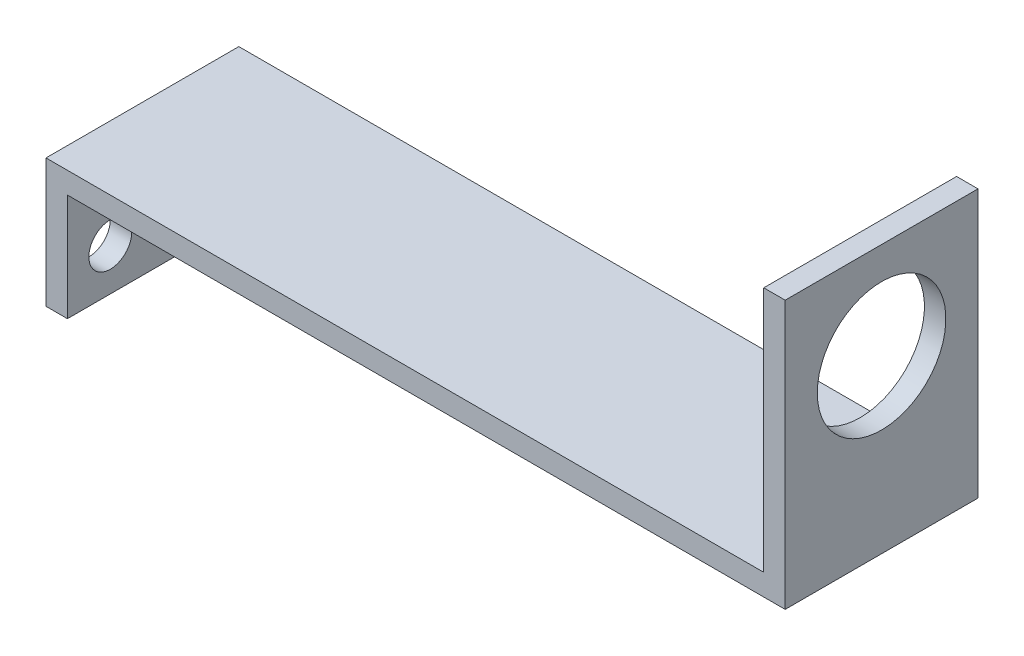
ISO-10303-21;
HEADER;
FILE_DESCRIPTION(('STEP AP214'),'2;1');
FILE_NAME('part.step','',(''),(''),'','','');
FILE_SCHEMA(('AUTOMOTIVE_DESIGN { 1 0 10303 214 1 1 1 1 }'));
ENDSEC;
DATA;
#1=APPLICATION_CONTEXT('core data for automotive mechanical design processes');
#2=APPLICATION_PROTOCOL_DEFINITION('international standard','automotive_design',2000,#1);
#3=PRODUCT_CONTEXT('',#1,'mechanical');
#4=PRODUCT('Part','Part','',(#3));
#5=PRODUCT_RELATED_PRODUCT_CATEGORY('part','',(#4));
#6=PRODUCT_DEFINITION_FORMATION('','',#4);
#7=PRODUCT_DEFINITION_CONTEXT('part definition',#1,'design');
#8=PRODUCT_DEFINITION('design','',#6,#7);
#9=PRODUCT_DEFINITION_SHAPE('','',#8);
#10=(LENGTH_UNIT() NAMED_UNIT(*) SI_UNIT(.MILLI.,.METRE.));
#11=(NAMED_UNIT(*) PLANE_ANGLE_UNIT() SI_UNIT($,.RADIAN.));
#12=(NAMED_UNIT(*) SI_UNIT($,.STERADIAN.) SOLID_ANGLE_UNIT());
#13=UNCERTAINTY_MEASURE_WITH_UNIT(LENGTH_MEASURE(1.E-05),#10,'distance_accuracy_value','');
#14=(GEOMETRIC_REPRESENTATION_CONTEXT(3) GLOBAL_UNCERTAINTY_ASSIGNED_CONTEXT((#13)) GLOBAL_UNIT_ASSIGNED_CONTEXT((#10,
#11,#12)) REPRESENTATION_CONTEXT('',''));
#15=CARTESIAN_POINT('',(0.,0.,0.));
#16=DIRECTION('',(0.,0.,1.));
#17=DIRECTION('',(1.,0.,0.));
#18=AXIS2_PLACEMENT_3D('',#15,#16,#17);
#19=CARTESIAN_POINT('',(2.,0.,18.));
#20=DIRECTION('',(0.,1.,0.));
#21=DIRECTION('',(-1.,0.,0.));
#22=AXIS2_PLACEMENT_3D('',#19,#20,#21);
#23=PLANE('',#22);
#24=DIRECTION('',(1.,0.,0.));
#25=VECTOR('',#24,1.);
#26=CARTESIAN_POINT('',(2.,0.,0.));
#27=LINE('',#26,#25);
#28=CARTESIAN_POINT('',(0.,0.,0.));
#29=VERTEX_POINT('',#28);
#30=CARTESIAN_POINT('',(2.,0.,0.));
#31=VERTEX_POINT('',#30);
#32=EDGE_CURVE('E129',#29,#31,#27,.T.);
#33=ORIENTED_EDGE('',*,*,#32,.T.);
#34=DIRECTION('',(0.,0.,-1.));
#35=VECTOR('',#34,1.);
#36=CARTESIAN_POINT('',(2.,0.,18.));
#37=LINE('',#36,#35);
#38=CARTESIAN_POINT('',(2.,0.,18.));
#39=VERTEX_POINT('',#38);
#40=EDGE_CURVE('E11',#39,#31,#37,.T.);
#41=ORIENTED_EDGE('',*,*,#40,.F.);
#42=DIRECTION('',(1.,0.,0.));
#43=VECTOR('',#42,1.);
#44=CARTESIAN_POINT('',(2.,0.,18.));
#45=LINE('',#44,#43);
#46=CARTESIAN_POINT('',(0.,0.,18.));
#47=VERTEX_POINT('',#46);
#48=EDGE_CURVE('E144',#47,#39,#45,.T.);
#49=ORIENTED_EDGE('',*,*,#48,.F.);
#50=DIRECTION('',(0.,0.,-1.));
#51=VECTOR('',#50,1.);
#52=CARTESIAN_POINT('',(0.,0.,18.));
#53=LINE('',#52,#51);
#54=EDGE_CURVE('E125',#47,#29,#53,.T.);
#55=ORIENTED_EDGE('',*,*,#54,.T.);
#56=EDGE_LOOP('',(#33,#41,#49,#55));
#57=FACE_BOUND('',#56,.T.);
#58=ADVANCED_FACE('F33',(#57),#23,.F.);
#59=CARTESIAN_POINT('',(2.,9.99999999999999,18.));
#60=DIRECTION('',(-1.,0.,0.));
#61=DIRECTION('',(0.,-1.,0.));
#62=AXIS2_PLACEMENT_3D('',#59,#60,#61);
#63=PLANE('',#62);
#64=CARTESIAN_POINT('',(2.,4.,4.));
#65=DIRECTION('',(-1.,0.,0.));
#66=DIRECTION('',(0.,-1.,0.));
#67=AXIS2_PLACEMENT_3D('',#64,#65,#66);
#68=CIRCLE('',#67,2.);
#69=CARTESIAN_POINT('',(2.,2.,4.));
#70=VERTEX_POINT('',#69);
#71=EDGE_CURVE('E133',#70,#70,#68,.F.);
#72=ORIENTED_EDGE('',*,*,#71,.F.);
#73=EDGE_LOOP('',(#72));
#74=FACE_BOUND('',#73,.T.);
#75=CARTESIAN_POINT('',(2.,4.,14.));
#76=DIRECTION('',(-1.,0.,0.));
#77=DIRECTION('',(0.,-1.,0.));
#78=AXIS2_PLACEMENT_3D('',#75,#76,#77);
#79=CIRCLE('',#78,2.);
#80=CARTESIAN_POINT('',(2.,2.,14.));
#81=VERTEX_POINT('',#80);
#82=EDGE_CURVE('E177',#81,#81,#79,.F.);
#83=ORIENTED_EDGE('',*,*,#82,.F.);
#84=EDGE_LOOP('',(#83));
#85=FACE_BOUND('',#84,.T.);
#86=DIRECTION('',(0.,1.,0.));
#87=VECTOR('',#86,1.);
#88=CARTESIAN_POINT('',(2.,9.99999999999999,0.));
#89=LINE('',#88,#87);
#90=CARTESIAN_POINT('',(2.,9.99999999999999,0.));
#91=VERTEX_POINT('',#90);
#92=EDGE_CURVE('E132',#31,#91,#89,.T.);
#93=ORIENTED_EDGE('',*,*,#92,.T.);
#94=DIRECTION('',(0.,0.,-1.));
#95=VECTOR('',#94,1.);
#96=CARTESIAN_POINT('',(2.,9.99999999999999,18.));
#97=LINE('',#96,#95);
#98=CARTESIAN_POINT('',(2.,9.99999999999999,18.));
#99=VERTEX_POINT('',#98);
#100=EDGE_CURVE('E41',#99,#91,#97,.T.);
#101=ORIENTED_EDGE('',*,*,#100,.F.);
#102=DIRECTION('',(0.,1.,0.));
#103=VECTOR('',#102,1.);
#104=CARTESIAN_POINT('',(2.,9.99999999999999,18.));
#105=LINE('',#104,#103);
#106=EDGE_CURVE('E92',#39,#99,#105,.T.);
#107=ORIENTED_EDGE('',*,*,#106,.F.);
#108=ORIENTED_EDGE('',*,*,#40,.T.);
#109=EDGE_LOOP('',(#93,#101,#107,#108));
#110=FACE_BOUND('',#109,.T.);
#111=ADVANCED_FACE('F208',(#74,#85,#110),#63,.F.);
#112=CARTESIAN_POINT('',(69.,10.,18.));
#113=DIRECTION('',(0.,1.,0.));
#114=DIRECTION('',(-1.,0.,0.));
#115=AXIS2_PLACEMENT_3D('',#112,#113,#114);
#116=PLANE('',#115);
#117=DIRECTION('',(1.,0.,0.));
#118=VECTOR('',#117,1.);
#119=CARTESIAN_POINT('',(69.,10.,0.));
#120=LINE('',#119,#118);
#121=CARTESIAN_POINT('',(69.,10.,0.));
#122=VERTEX_POINT('',#121);
#123=EDGE_CURVE('E135',#91,#122,#120,.T.);
#124=ORIENTED_EDGE('',*,*,#123,.T.);
#125=DIRECTION('',(0.,0.,-1.));
#126=VECTOR('',#125,1.);
#127=CARTESIAN_POINT('',(69.,10.,18.));
#128=LINE('',#127,#126);
#129=CARTESIAN_POINT('',(69.,10.,18.));
#130=VERTEX_POINT('',#129);
#131=EDGE_CURVE('E151',#130,#122,#128,.T.);
#132=ORIENTED_EDGE('',*,*,#131,.F.);
#133=DIRECTION('',(1.,0.,0.));
#134=VECTOR('',#133,1.);
#135=CARTESIAN_POINT('',(69.,10.,18.));
#136=LINE('',#135,#134);
#137=EDGE_CURVE('E159',#99,#130,#136,.T.);
#138=ORIENTED_EDGE('',*,*,#137,.F.);
#139=ORIENTED_EDGE('',*,*,#100,.T.);
#140=EDGE_LOOP('',(#124,#132,#138,#139));
#141=FACE_BOUND('',#140,.T.);
#142=ADVANCED_FACE('F157',(#141),#116,.F.);
#143=CARTESIAN_POINT('',(69.,35.,18.));
#144=DIRECTION('',(-1.,0.,0.));
#145=DIRECTION('',(0.,0.,1.));
#146=AXIS2_PLACEMENT_3D('',#143,#144,#145);
#147=PLANE('',#146);
#148=CARTESIAN_POINT('',(69.,26.,9.));
#149=DIRECTION('',(-1.,0.,0.));
#150=DIRECTION('',(0.,0.,1.));
#151=AXIS2_PLACEMENT_3D('',#148,#149,#150);
#152=CIRCLE('',#151,6.);
#153=CARTESIAN_POINT('',(69.,26.,15.));
#154=VERTEX_POINT('',#153);
#155=EDGE_CURVE('E184',#154,#154,#152,.F.);
#156=ORIENTED_EDGE('',*,*,#155,.F.);
#157=EDGE_LOOP('',(#156));
#158=FACE_BOUND('',#157,.T.);
#159=DIRECTION('',(0.,1.,0.));
#160=VECTOR('',#159,1.);
#161=CARTESIAN_POINT('',(69.,35.,0.));
#162=LINE('',#161,#160);
#163=CARTESIAN_POINT('',(69.,35.,0.));
#164=VERTEX_POINT('',#163);
#165=EDGE_CURVE('E137',#122,#164,#162,.T.);
#166=ORIENTED_EDGE('',*,*,#165,.T.);
#167=DIRECTION('',(0.,0.,-1.));
#168=VECTOR('',#167,1.);
#169=CARTESIAN_POINT('',(69.,35.,18.));
#170=LINE('',#169,#168);
#171=CARTESIAN_POINT('',(69.,35.,18.));
#172=VERTEX_POINT('',#171);
#173=EDGE_CURVE('E148',#172,#164,#170,.T.);
#174=ORIENTED_EDGE('',*,*,#173,.F.);
#175=DIRECTION('',(0.,1.,0.));
#176=VECTOR('',#175,1.);
#177=CARTESIAN_POINT('',(69.,35.,18.));
#178=LINE('',#177,#176);
#179=EDGE_CURVE('E171',#130,#172,#178,.T.);
#180=ORIENTED_EDGE('',*,*,#179,.F.);
#181=ORIENTED_EDGE('',*,*,#131,.T.);
#182=EDGE_LOOP('',(#166,#174,#180,#181));
#183=FACE_BOUND('',#182,.T.);
#184=ADVANCED_FACE('F167',(#158,#183),#147,.F.);
#185=CARTESIAN_POINT('',(67.,35.,18.));
#186=DIRECTION('',(0.,-1.,0.));
#187=DIRECTION('',(0.,0.,-1.));
#188=AXIS2_PLACEMENT_3D('',#185,#186,#187);
#189=PLANE('',#188);
#190=DIRECTION('',(-1.,0.,0.));
#191=VECTOR('',#190,1.);
#192=CARTESIAN_POINT('',(67.,35.,0.));
#193=LINE('',#192,#191);
#194=CARTESIAN_POINT('',(67.,35.,0.));
#195=VERTEX_POINT('',#194);
#196=EDGE_CURVE('E139',#164,#195,#193,.T.);
#197=ORIENTED_EDGE('',*,*,#196,.T.);
#198=DIRECTION('',(0.,0.,-1.));
#199=VECTOR('',#198,1.);
#200=CARTESIAN_POINT('',(67.,35.,18.));
#201=LINE('',#200,#199);
#202=CARTESIAN_POINT('',(67.,35.,18.));
#203=VERTEX_POINT('',#202);
#204=EDGE_CURVE('E120',#203,#195,#201,.T.);
#205=ORIENTED_EDGE('',*,*,#204,.F.);
#206=DIRECTION('',(-1.,0.,0.));
#207=VECTOR('',#206,1.);
#208=CARTESIAN_POINT('',(67.,35.,18.));
#209=LINE('',#208,#207);
#210=EDGE_CURVE('E111',#172,#203,#209,.T.);
#211=ORIENTED_EDGE('',*,*,#210,.F.);
#212=ORIENTED_EDGE('',*,*,#173,.T.);
#213=EDGE_LOOP('',(#197,#205,#211,#212));
#214=FACE_BOUND('',#213,.T.);
#215=ADVANCED_FACE('F170',(#214),#189,.F.);
#216=CARTESIAN_POINT('',(67.,12.,18.));
#217=DIRECTION('',(1.,0.,0.));
#218=DIRECTION('',(0.,0.,-1.));
#219=AXIS2_PLACEMENT_3D('',#216,#217,#218);
#220=PLANE('',#219);
#221=CARTESIAN_POINT('',(67.,26.,9.));
#222=DIRECTION('',(-1.,0.,0.));
#223=DIRECTION('',(0.,0.,1.));
#224=AXIS2_PLACEMENT_3D('',#221,#222,#223);
#225=CIRCLE('',#224,6.);
#226=CARTESIAN_POINT('',(67.,26.,15.));
#227=VERTEX_POINT('',#226);
#228=EDGE_CURVE('E191',#227,#227,#225,.T.);
#229=ORIENTED_EDGE('',*,*,#228,.F.);
#230=EDGE_LOOP('',(#229));
#231=FACE_BOUND('',#230,.T.);
#232=DIRECTION('',(0.,-1.,0.));
#233=VECTOR('',#232,1.);
#234=CARTESIAN_POINT('',(67.,12.,0.));
#235=LINE('',#234,#233);
#236=CARTESIAN_POINT('',(67.,12.,0.));
#237=VERTEX_POINT('',#236);
#238=EDGE_CURVE('E119',#195,#237,#235,.T.);
#239=ORIENTED_EDGE('',*,*,#238,.T.);
#240=DIRECTION('',(0.,0.,-1.));
#241=VECTOR('',#240,1.);
#242=CARTESIAN_POINT('',(67.,12.,18.));
#243=LINE('',#242,#241);
#244=CARTESIAN_POINT('',(67.,12.,18.));
#245=VERTEX_POINT('',#244);
#246=EDGE_CURVE('E116',#245,#237,#243,.T.);
#247=ORIENTED_EDGE('',*,*,#246,.F.);
#248=DIRECTION('',(0.,-1.,0.));
#249=VECTOR('',#248,1.);
#250=CARTESIAN_POINT('',(67.,12.,18.));
#251=LINE('',#250,#249);
#252=EDGE_CURVE('E105',#203,#245,#251,.T.);
#253=ORIENTED_EDGE('',*,*,#252,.F.);
#254=ORIENTED_EDGE('',*,*,#204,.T.);
#255=EDGE_LOOP('',(#239,#247,#253,#254));
#256=FACE_BOUND('',#255,.T.);
#257=ADVANCED_FACE('F117',(#231,#256),#220,.F.);
#258=CARTESIAN_POINT('',(0.,12.,18.));
#259=DIRECTION('',(0.,-1.,0.));
#260=DIRECTION('',(0.,0.,-1.));
#261=AXIS2_PLACEMENT_3D('',#258,#259,#260);
#262=PLANE('',#261);
#263=DIRECTION('',(-1.,0.,0.));
#264=VECTOR('',#263,1.);
#265=CARTESIAN_POINT('',(0.,12.,0.));
#266=LINE('',#265,#264);
#267=CARTESIAN_POINT('',(0.,12.,0.));
#268=VERTEX_POINT('',#267);
#269=EDGE_CURVE('E78',#237,#268,#266,.T.);
#270=ORIENTED_EDGE('',*,*,#269,.T.);
#271=DIRECTION('',(0.,0.,-1.));
#272=VECTOR('',#271,1.);
#273=CARTESIAN_POINT('',(0.,12.,18.));
#274=LINE('',#273,#272);
#275=CARTESIAN_POINT('',(0.,12.,18.));
#276=VERTEX_POINT('',#275);
#277=EDGE_CURVE('E121',#276,#268,#274,.T.);
#278=ORIENTED_EDGE('',*,*,#277,.F.);
#279=DIRECTION('',(-1.,0.,0.));
#280=VECTOR('',#279,1.);
#281=CARTESIAN_POINT('',(0.,12.,18.));
#282=LINE('',#281,#280);
#283=EDGE_CURVE('E109',#245,#276,#282,.T.);
#284=ORIENTED_EDGE('',*,*,#283,.F.);
#285=ORIENTED_EDGE('',*,*,#246,.T.);
#286=EDGE_LOOP('',(#270,#278,#284,#285));
#287=FACE_BOUND('',#286,.T.);
#288=ADVANCED_FACE('F123',(#287),#262,.F.);
#289=CARTESIAN_POINT('',(0.,0.,18.));
#290=DIRECTION('',(1.,0.,0.));
#291=DIRECTION('',(0.,0.,-1.));
#292=AXIS2_PLACEMENT_3D('',#289,#290,#291);
#293=PLANE('',#292);
#294=CARTESIAN_POINT('',(0.,4.,4.));
#295=DIRECTION('',(-1.,0.,0.));
#296=DIRECTION('',(0.,0.,1.));
#297=AXIS2_PLACEMENT_3D('',#294,#295,#296);
#298=CIRCLE('',#297,2.);
#299=CARTESIAN_POINT('',(0.,4.,6.));
#300=VERTEX_POINT('',#299);
#301=EDGE_CURVE('E180',#300,#300,#298,.T.);
#302=ORIENTED_EDGE('',*,*,#301,.F.);
#303=EDGE_LOOP('',(#302));
#304=FACE_BOUND('',#303,.T.);
#305=CARTESIAN_POINT('',(0.,4.,14.));
#306=DIRECTION('',(-1.,0.,0.));
#307=DIRECTION('',(0.,0.,1.));
#308=AXIS2_PLACEMENT_3D('',#305,#306,#307);
#309=CIRCLE('',#308,2.);
#310=CARTESIAN_POINT('',(0.,4.,16.));
#311=VERTEX_POINT('',#310);
#312=EDGE_CURVE('E181',#311,#311,#309,.T.);
#313=ORIENTED_EDGE('',*,*,#312,.F.);
#314=EDGE_LOOP('',(#313));
#315=FACE_BOUND('',#314,.T.);
#316=DIRECTION('',(0.,-1.,0.));
#317=VECTOR('',#316,1.);
#318=CARTESIAN_POINT('',(0.,0.,0.));
#319=LINE('',#318,#317);
#320=EDGE_CURVE('E84',#268,#29,#319,.T.);
#321=ORIENTED_EDGE('',*,*,#320,.T.);
#322=ORIENTED_EDGE('',*,*,#54,.F.);
#323=DIRECTION('',(0.,-1.,0.));
#324=VECTOR('',#323,1.);
#325=CARTESIAN_POINT('',(0.,0.,18.));
#326=LINE('',#325,#324);
#327=EDGE_CURVE('E49',#276,#47,#326,.T.);
#328=ORIENTED_EDGE('',*,*,#327,.F.);
#329=ORIENTED_EDGE('',*,*,#277,.T.);
#330=EDGE_LOOP('',(#321,#322,#328,#329));
#331=FACE_BOUND('',#330,.T.);
#332=ADVANCED_FACE('F204',(#304,#315,#331),#293,.F.);
#333=CARTESIAN_POINT('',(0.,0.,18.));
#334=DIRECTION('',(0.,0.,-1.));
#335=DIRECTION('',(-1.,0.,0.));
#336=AXIS2_PLACEMENT_3D('',#333,#334,#335);
#337=PLANE('',#336);
#338=ORIENTED_EDGE('',*,*,#48,.T.);
#339=ORIENTED_EDGE('',*,*,#106,.T.);
#340=ORIENTED_EDGE('',*,*,#137,.T.);
#341=ORIENTED_EDGE('',*,*,#179,.T.);
#342=ORIENTED_EDGE('',*,*,#210,.T.);
#343=ORIENTED_EDGE('',*,*,#252,.T.);
#344=ORIENTED_EDGE('',*,*,#283,.T.);
#345=ORIENTED_EDGE('',*,*,#327,.T.);
#346=EDGE_LOOP('',(#338,#339,#340,#341,#342,#343,#344,#345));
#347=FACE_BOUND('',#346,.T.);
#348=ADVANCED_FACE('F107',(#347),#337,.F.);
#349=CARTESIAN_POINT('',(0.,0.,0.));
#350=DIRECTION('',(0.,0.,-1.));
#351=DIRECTION('',(-1.,0.,0.));
#352=AXIS2_PLACEMENT_3D('',#349,#350,#351);
#353=PLANE('',#352);
#354=ORIENTED_EDGE('',*,*,#32,.F.);
#355=ORIENTED_EDGE('',*,*,#320,.F.);
#356=ORIENTED_EDGE('',*,*,#269,.F.);
#357=ORIENTED_EDGE('',*,*,#238,.F.);
#358=ORIENTED_EDGE('',*,*,#196,.F.);
#359=ORIENTED_EDGE('',*,*,#165,.F.);
#360=ORIENTED_EDGE('',*,*,#123,.F.);
#361=ORIENTED_EDGE('',*,*,#92,.F.);
#362=EDGE_LOOP('',(#354,#355,#356,#357,#358,#359,#360,#361));
#363=FACE_BOUND('',#362,.T.);
#364=ADVANCED_FACE('F163',(#363),#353,.T.);
#365=CARTESIAN_POINT('',(69.001,4.,14.));
#366=DIRECTION('',(-1.,0.,0.));
#367=DIRECTION('',(0.,0.,1.));
#368=AXIS2_PLACEMENT_3D('',#365,#366,#367);
#369=CYLINDRICAL_SURFACE('',#368,2.);
#370=ORIENTED_EDGE('',*,*,#312,.T.);
#371=EDGE_LOOP('',(#370));
#372=FACE_BOUND('',#371,.T.);
#373=ORIENTED_EDGE('',*,*,#82,.T.);
#374=EDGE_LOOP('',(#373));
#375=FACE_BOUND('',#374,.T.);
#376=ADVANCED_FACE('F227',(#372,#375),#369,.F.);
#377=CARTESIAN_POINT('',(69.001,4.,4.));
#378=DIRECTION('',(-1.,0.,0.));
#379=DIRECTION('',(0.,0.,1.));
#380=AXIS2_PLACEMENT_3D('',#377,#378,#379);
#381=CYLINDRICAL_SURFACE('',#380,2.);
#382=ORIENTED_EDGE('',*,*,#301,.T.);
#383=EDGE_LOOP('',(#382));
#384=FACE_BOUND('',#383,.T.);
#385=ORIENTED_EDGE('',*,*,#71,.T.);
#386=EDGE_LOOP('',(#385));
#387=FACE_BOUND('',#386,.T.);
#388=ADVANCED_FACE('F231',(#384,#387),#381,.F.);
#389=CARTESIAN_POINT('',(69.001,26.,9.));
#390=DIRECTION('',(-1.,0.,0.));
#391=DIRECTION('',(0.,0.,1.));
#392=AXIS2_PLACEMENT_3D('',#389,#390,#391);
#393=CYLINDRICAL_SURFACE('',#392,6.);
#394=ORIENTED_EDGE('',*,*,#228,.T.);
#395=EDGE_LOOP('',(#394));
#396=FACE_BOUND('',#395,.T.);
#397=ORIENTED_EDGE('',*,*,#155,.T.);
#398=EDGE_LOOP('',(#397));
#399=FACE_BOUND('',#398,.T.);
#400=ADVANCED_FACE('F195',(#396,#399),#393,.F.);
#401=CLOSED_SHELL('',(#58,#111,#142,#184,#215,#257,#288,#332,#348,#364,#376,#388,#400));
#402=MANIFOLD_SOLID_BREP('B2',#401);
#403=ADVANCED_BREP_SHAPE_REPRESENTATION('',(#18,#402),#14);
#404=SHAPE_DEFINITION_REPRESENTATION(#9,#403);
ENDSEC;
END-ISO-10303-21;
